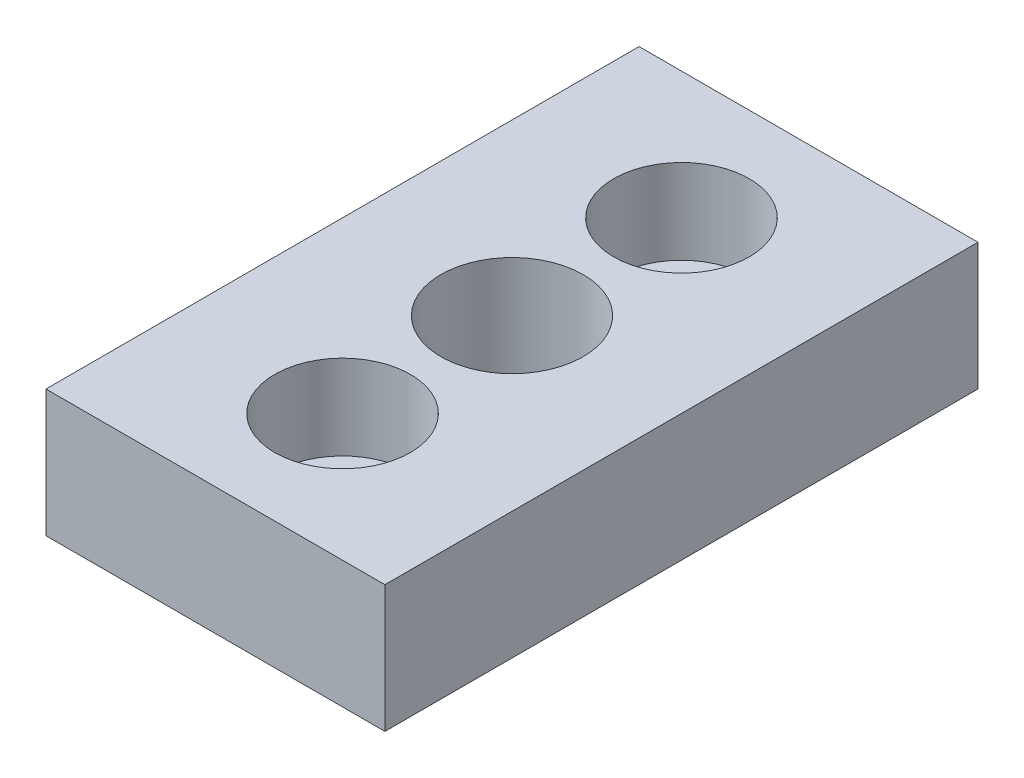
ISO-10303-21;
HEADER;
FILE_DESCRIPTION(('STEP AP214'),'2;1');
FILE_NAME('part.step','',(''),(''),'','','');
FILE_SCHEMA(('AUTOMOTIVE_DESIGN { 1 0 10303 214 1 1 1 1 }'));
ENDSEC;
DATA;
#1=APPLICATION_CONTEXT('core data for automotive mechanical design processes');
#2=APPLICATION_PROTOCOL_DEFINITION('international standard','automotive_design',2000,#1);
#3=PRODUCT_CONTEXT('',#1,'mechanical');
#4=PRODUCT('Part','Part','',(#3));
#5=PRODUCT_RELATED_PRODUCT_CATEGORY('part','',(#4));
#6=PRODUCT_DEFINITION_FORMATION('','',#4);
#7=PRODUCT_DEFINITION_CONTEXT('part definition',#1,'design');
#8=PRODUCT_DEFINITION('design','',#6,#7);
#9=PRODUCT_DEFINITION_SHAPE('','',#8);
#10=(LENGTH_UNIT() NAMED_UNIT(*) SI_UNIT(.MILLI.,.METRE.));
#11=(NAMED_UNIT(*) PLANE_ANGLE_UNIT() SI_UNIT($,.RADIAN.));
#12=(NAMED_UNIT(*) SI_UNIT($,.STERADIAN.) SOLID_ANGLE_UNIT());
#13=UNCERTAINTY_MEASURE_WITH_UNIT(LENGTH_MEASURE(1.E-05),#10,'distance_accuracy_value','');
#14=(GEOMETRIC_REPRESENTATION_CONTEXT(3) GLOBAL_UNCERTAINTY_ASSIGNED_CONTEXT((#13)) GLOBAL_UNIT_ASSIGNED_CONTEXT((#10,
#11,#12)) REPRESENTATION_CONTEXT('',''));
#15=CARTESIAN_POINT('',(0.,0.,0.));
#16=DIRECTION('',(0.,0.,1.));
#17=DIRECTION('',(1.,0.,0.));
#18=AXIS2_PLACEMENT_3D('',#15,#16,#17);
#19=CARTESIAN_POINT('',(0.,7.5,9.99999999999982));
#20=DIRECTION('',(0.,-1.,0.));
#21=DIRECTION('',(0.,0.,-1.));
#22=AXIS2_PLACEMENT_3D('',#19,#20,#21);
#23=CYLINDRICAL_SURFACE('',#22,2.5);
#24=CARTESIAN_POINT('',(0.,0.,9.99999999999982));
#25=DIRECTION('',(0.,-1.,0.));
#26=DIRECTION('',(0.,0.,-1.));
#27=AXIS2_PLACEMENT_3D('',#24,#25,#26);
#28=CIRCLE('',#27,2.5);
#29=CARTESIAN_POINT('',(0.,0.,7.49999999999982));
#30=VERTEX_POINT('',#29);
#31=EDGE_CURVE('E150',#30,#30,#28,.T.);
#32=ORIENTED_EDGE('',*,*,#31,.T.);
#33=EDGE_LOOP('',(#32));
#34=FACE_BOUND('',#33,.T.);
#35=CARTESIAN_POINT('',(0.,2.5,9.99999999999982));
#36=DIRECTION('',(0.,1.,0.));
#37=DIRECTION('',(0.,0.,1.));
#38=AXIS2_PLACEMENT_3D('',#35,#36,#37);
#39=CIRCLE('',#38,2.5);
#40=CARTESIAN_POINT('',(0.,2.5,12.4999999999998));
#41=VERTEX_POINT('',#40);
#42=EDGE_CURVE('E46',#41,#41,#39,.F.);
#43=ORIENTED_EDGE('',*,*,#42,.F.);
#44=EDGE_LOOP('',(#43));
#45=FACE_BOUND('',#44,.T.);
#46=ADVANCED_FACE('F42',(#34,#45),#23,.F.);
#47=CARTESIAN_POINT('',(0.,7.5,-10.0000000000002));
#48=DIRECTION('',(0.,-1.,0.));
#49=DIRECTION('',(0.,0.,-1.));
#50=AXIS2_PLACEMENT_3D('',#47,#48,#49);
#51=CYLINDRICAL_SURFACE('',#50,2.5);
#52=CARTESIAN_POINT('',(0.,0.,-10.0000000000002));
#53=DIRECTION('',(0.,-1.,0.));
#54=DIRECTION('',(0.,0.,-1.));
#55=AXIS2_PLACEMENT_3D('',#52,#53,#54);
#56=CIRCLE('',#55,2.5);
#57=CARTESIAN_POINT('',(0.,0.,-12.5000000000002));
#58=VERTEX_POINT('',#57);
#59=EDGE_CURVE('E167',#58,#58,#56,.T.);
#60=ORIENTED_EDGE('',*,*,#59,.T.);
#61=EDGE_LOOP('',(#60));
#62=FACE_BOUND('',#61,.T.);
#63=CARTESIAN_POINT('',(0.,2.5,-10.0000000000002));
#64=DIRECTION('',(0.,1.,0.));
#65=DIRECTION('',(0.,0.,1.));
#66=AXIS2_PLACEMENT_3D('',#63,#64,#65);
#67=CIRCLE('',#66,2.5);
#68=CARTESIAN_POINT('',(0.,2.5,-7.50000000000018));
#69=VERTEX_POINT('',#68);
#70=EDGE_CURVE('E140',#69,#69,#67,.F.);
#71=ORIENTED_EDGE('',*,*,#70,.F.);
#72=EDGE_LOOP('',(#71));
#73=FACE_BOUND('',#72,.T.);
#74=ADVANCED_FACE('F189',(#62,#73),#51,.F.);
#75=CARTESIAN_POINT('',(-10.,7.5,17.5));
#76=DIRECTION('',(-1.,0.,0.));
#77=DIRECTION('',(0.,0.,1.));
#78=AXIS2_PLACEMENT_3D('',#75,#76,#77);
#79=PLANE('',#78);
#80=DIRECTION('',(0.,0.,-1.));
#81=VECTOR('',#80,1.);
#82=CARTESIAN_POINT('',(-10.,0.,17.5));
#83=LINE('',#82,#81);
#84=CARTESIAN_POINT('',(-10.,0.,17.5));
#85=VERTEX_POINT('',#84);
#86=CARTESIAN_POINT('',(-10.,0.,-17.5));
#87=VERTEX_POINT('',#86);
#88=EDGE_CURVE('E125',#85,#87,#83,.T.);
#89=ORIENTED_EDGE('',*,*,#88,.F.);
#90=DIRECTION('',(0.,-1.,0.));
#91=VECTOR('',#90,1.);
#92=CARTESIAN_POINT('',(-10.,7.5,17.5));
#93=LINE('',#92,#91);
#94=CARTESIAN_POINT('',(-10.,7.5,17.5));
#95=VERTEX_POINT('',#94);
#96=EDGE_CURVE('E11',#95,#85,#93,.T.);
#97=ORIENTED_EDGE('',*,*,#96,.F.);
#98=DIRECTION('',(0.,0.,-1.));
#99=VECTOR('',#98,1.);
#100=CARTESIAN_POINT('',(-10.,7.5,17.5));
#101=LINE('',#100,#99);
#102=CARTESIAN_POINT('',(-10.,7.5,-17.5));
#103=VERTEX_POINT('',#102);
#104=EDGE_CURVE('E116',#95,#103,#101,.T.);
#105=ORIENTED_EDGE('',*,*,#104,.T.);
#106=DIRECTION('',(0.,-1.,0.));
#107=VECTOR('',#106,1.);
#108=CARTESIAN_POINT('',(-10.,7.5,-17.5));
#109=LINE('',#108,#107);
#110=EDGE_CURVE('E92',#103,#87,#109,.T.);
#111=ORIENTED_EDGE('',*,*,#110,.T.);
#112=EDGE_LOOP('',(#89,#97,#105,#111));
#113=FACE_BOUND('',#112,.T.);
#114=ADVANCED_FACE('F44',(#113),#79,.T.);
#115=CARTESIAN_POINT('',(-10.,7.5,17.5));
#116=DIRECTION('',(0.,0.,-1.));
#117=DIRECTION('',(-1.,0.,0.));
#118=AXIS2_PLACEMENT_3D('',#115,#116,#117);
#119=PLANE('',#118);
#120=DIRECTION('',(1.,0.,0.));
#121=VECTOR('',#120,1.);
#122=CARTESIAN_POINT('',(-10.,0.,17.5));
#123=LINE('',#122,#121);
#124=CARTESIAN_POINT('',(10.,0.,17.5));
#125=VERTEX_POINT('',#124);
#126=EDGE_CURVE('E83',#85,#125,#123,.T.);
#127=ORIENTED_EDGE('',*,*,#126,.T.);
#128=DIRECTION('',(0.,-1.,0.));
#129=VECTOR('',#128,1.);
#130=CARTESIAN_POINT('',(10.,7.5,17.5));
#131=LINE('',#130,#129);
#132=CARTESIAN_POINT('',(10.,7.5,17.5));
#133=VERTEX_POINT('',#132);
#134=EDGE_CURVE('E53',#133,#125,#131,.T.);
#135=ORIENTED_EDGE('',*,*,#134,.F.);
#136=DIRECTION('',(1.,0.,0.));
#137=VECTOR('',#136,1.);
#138=CARTESIAN_POINT('',(-10.,7.5,17.5));
#139=LINE('',#138,#137);
#140=EDGE_CURVE('E102',#95,#133,#139,.T.);
#141=ORIENTED_EDGE('',*,*,#140,.F.);
#142=ORIENTED_EDGE('',*,*,#96,.T.);
#143=EDGE_LOOP('',(#127,#135,#141,#142));
#144=FACE_BOUND('',#143,.T.);
#145=ADVANCED_FACE('F188',(#144),#119,.F.);
#146=CARTESIAN_POINT('',(10.,7.5,17.5));
#147=DIRECTION('',(-1.,0.,0.));
#148=DIRECTION('',(0.,0.,1.));
#149=AXIS2_PLACEMENT_3D('',#146,#147,#148);
#150=PLANE('',#149);
#151=DIRECTION('',(0.,0.,-1.));
#152=VECTOR('',#151,1.);
#153=CARTESIAN_POINT('',(10.,0.,17.5));
#154=LINE('',#153,#152);
#155=CARTESIAN_POINT('',(10.,0.,-17.5));
#156=VERTEX_POINT('',#155);
#157=EDGE_CURVE('E110',#125,#156,#154,.T.);
#158=ORIENTED_EDGE('',*,*,#157,.T.);
#159=DIRECTION('',(0.,-1.,0.));
#160=VECTOR('',#159,1.);
#161=CARTESIAN_POINT('',(10.,7.5,-17.5));
#162=LINE('',#161,#160);
#163=CARTESIAN_POINT('',(10.,7.5,-17.5));
#164=VERTEX_POINT('',#163);
#165=EDGE_CURVE('E107',#164,#156,#162,.T.);
#166=ORIENTED_EDGE('',*,*,#165,.F.);
#167=DIRECTION('',(0.,0.,-1.));
#168=VECTOR('',#167,1.);
#169=CARTESIAN_POINT('',(10.,7.5,17.5));
#170=LINE('',#169,#168);
#171=EDGE_CURVE('E97',#133,#164,#170,.T.);
#172=ORIENTED_EDGE('',*,*,#171,.F.);
#173=ORIENTED_EDGE('',*,*,#134,.T.);
#174=EDGE_LOOP('',(#158,#166,#172,#173));
#175=FACE_BOUND('',#174,.T.);
#176=ADVANCED_FACE('F108',(#175),#150,.F.);
#177=CARTESIAN_POINT('',(-10.,7.5,-17.5));
#178=DIRECTION('',(0.,0.,-1.));
#179=DIRECTION('',(-1.,0.,0.));
#180=AXIS2_PLACEMENT_3D('',#177,#178,#179);
#181=PLANE('',#180);
#182=DIRECTION('',(1.,0.,0.));
#183=VECTOR('',#182,1.);
#184=CARTESIAN_POINT('',(-10.,0.,-17.5));
#185=LINE('',#184,#183);
#186=EDGE_CURVE('E129',#87,#156,#185,.T.);
#187=ORIENTED_EDGE('',*,*,#186,.F.);
#188=ORIENTED_EDGE('',*,*,#110,.F.);
#189=DIRECTION('',(1.,0.,0.));
#190=VECTOR('',#189,1.);
#191=CARTESIAN_POINT('',(-10.,7.5,-17.5));
#192=LINE('',#191,#190);
#193=EDGE_CURVE('E101',#103,#164,#192,.T.);
#194=ORIENTED_EDGE('',*,*,#193,.T.);
#195=ORIENTED_EDGE('',*,*,#165,.T.);
#196=EDGE_LOOP('',(#187,#188,#194,#195));
#197=FACE_BOUND('',#196,.T.);
#198=ADVANCED_FACE('F114',(#197),#181,.T.);
#199=CARTESIAN_POINT('',(0.,7.5,0.));
#200=DIRECTION('',(0.,-1.,0.));
#201=DIRECTION('',(0.,0.,-1.));
#202=AXIS2_PLACEMENT_3D('',#199,#200,#201);
#203=PLANE('',#202);
#204=CARTESIAN_POINT('',(0.,7.5,-10.0000000000002));
#205=DIRECTION('',(0.,1.,0.));
#206=DIRECTION('',(0.,0.,1.));
#207=AXIS2_PLACEMENT_3D('',#204,#205,#206);
#208=CIRCLE('',#207,4.);
#209=CARTESIAN_POINT('',(0.,7.5,-6.00000000000018));
#210=VERTEX_POINT('',#209);
#211=EDGE_CURVE('E152',#210,#210,#208,.T.);
#212=ORIENTED_EDGE('',*,*,#211,.F.);
#213=EDGE_LOOP('',(#212));
#214=FACE_BOUND('',#213,.T.);
#215=CARTESIAN_POINT('',(0.,7.5,9.99999999999982));
#216=DIRECTION('',(0.,1.,0.));
#217=DIRECTION('',(0.,0.,1.));
#218=AXIS2_PLACEMENT_3D('',#215,#216,#217);
#219=CIRCLE('',#218,4.);
#220=CARTESIAN_POINT('',(0.,7.5,13.9999999999998));
#221=VERTEX_POINT('',#220);
#222=EDGE_CURVE('E163',#221,#221,#219,.T.);
#223=ORIENTED_EDGE('',*,*,#222,.F.);
#224=EDGE_LOOP('',(#223));
#225=FACE_BOUND('',#224,.T.);
#226=CARTESIAN_POINT('',(0.,7.5,0.));
#227=DIRECTION('',(0.,-1.,0.));
#228=DIRECTION('',(0.,0.,-1.));
#229=AXIS2_PLACEMENT_3D('',#226,#227,#228);
#230=CIRCLE('',#229,4.2);
#231=CARTESIAN_POINT('',(0.,7.5,-4.2));
#232=VERTEX_POINT('',#231);
#233=EDGE_CURVE('E130',#232,#232,#230,.T.);
#234=ORIENTED_EDGE('',*,*,#233,.T.);
#235=EDGE_LOOP('',(#234));
#236=FACE_BOUND('',#235,.T.);
#237=ORIENTED_EDGE('',*,*,#104,.F.);
#238=ORIENTED_EDGE('',*,*,#140,.T.);
#239=ORIENTED_EDGE('',*,*,#171,.T.);
#240=ORIENTED_EDGE('',*,*,#193,.F.);
#241=EDGE_LOOP('',(#237,#238,#239,#240));
#242=FACE_BOUND('',#241,.T.);
#243=ADVANCED_FACE('F100',(#214,#225,#236,#242),#203,.F.);
#244=CARTESIAN_POINT('',(0.,0.,0.));
#245=DIRECTION('',(0.,-1.,0.));
#246=DIRECTION('',(0.,0.,-1.));
#247=AXIS2_PLACEMENT_3D('',#244,#245,#246);
#248=PLANE('',#247);
#249=ORIENTED_EDGE('',*,*,#59,.F.);
#250=EDGE_LOOP('',(#249));
#251=FACE_BOUND('',#250,.T.);
#252=ORIENTED_EDGE('',*,*,#31,.F.);
#253=EDGE_LOOP('',(#252));
#254=FACE_BOUND('',#253,.T.);
#255=CARTESIAN_POINT('',(0.,0.,0.));
#256=DIRECTION('',(0.,-1.,0.));
#257=DIRECTION('',(0.,0.,-1.));
#258=AXIS2_PLACEMENT_3D('',#255,#256,#257);
#259=CIRCLE('',#258,4.2);
#260=CARTESIAN_POINT('',(0.,0.,-4.2));
#261=VERTEX_POINT('',#260);
#262=EDGE_CURVE('E170',#261,#261,#259,.T.);
#263=ORIENTED_EDGE('',*,*,#262,.F.);
#264=EDGE_LOOP('',(#263));
#265=FACE_BOUND('',#264,.T.);
#266=ORIENTED_EDGE('',*,*,#88,.T.);
#267=ORIENTED_EDGE('',*,*,#186,.T.);
#268=ORIENTED_EDGE('',*,*,#157,.F.);
#269=ORIENTED_EDGE('',*,*,#126,.F.);
#270=EDGE_LOOP('',(#266,#267,#268,#269));
#271=FACE_BOUND('',#270,.T.);
#272=ADVANCED_FACE('F182',(#251,#254,#265,#271),#248,.T.);
#273=CARTESIAN_POINT('',(0.,7.5,0.));
#274=DIRECTION('',(0.,-1.,0.));
#275=DIRECTION('',(0.,0.,-1.));
#276=AXIS2_PLACEMENT_3D('',#273,#274,#275);
#277=CYLINDRICAL_SURFACE('',#276,4.2);
#278=ORIENTED_EDGE('',*,*,#233,.F.);
#279=EDGE_LOOP('',(#278));
#280=FACE_BOUND('',#279,.T.);
#281=ORIENTED_EDGE('',*,*,#262,.T.);
#282=EDGE_LOOP('',(#281));
#283=FACE_BOUND('',#282,.T.);
#284=ADVANCED_FACE('F180',(#280,#283),#277,.F.);
#285=CARTESIAN_POINT('',(0.,2.5,-10.0000000000002));
#286=DIRECTION('',(0.,1.,0.));
#287=DIRECTION('',(0.,0.,1.));
#288=AXIS2_PLACEMENT_3D('',#285,#286,#287);
#289=PLANE('',#288);
#290=CARTESIAN_POINT('',(0.,2.5,-10.0000000000002));
#291=DIRECTION('',(0.,1.,0.));
#292=DIRECTION('',(0.,0.,1.));
#293=AXIS2_PLACEMENT_3D('',#290,#291,#292);
#294=CIRCLE('',#293,4.);
#295=CARTESIAN_POINT('',(0.,2.5,-6.00000000000018));
#296=VERTEX_POINT('',#295);
#297=EDGE_CURVE('E143',#296,#296,#294,.T.);
#298=ORIENTED_EDGE('',*,*,#297,.T.);
#299=EDGE_LOOP('',(#298));
#300=FACE_BOUND('',#299,.T.);
#301=ORIENTED_EDGE('',*,*,#70,.T.);
#302=EDGE_LOOP('',(#301));
#303=FACE_BOUND('',#302,.T.);
#304=ADVANCED_FACE('F207',(#300,#303),#289,.T.);
#305=CARTESIAN_POINT('',(0.,2.5,-10.0000000000002));
#306=DIRECTION('',(0.,1.,0.));
#307=DIRECTION('',(0.,0.,1.));
#308=AXIS2_PLACEMENT_3D('',#305,#306,#307);
#309=CYLINDRICAL_SURFACE('',#308,4.);
#310=ORIENTED_EDGE('',*,*,#297,.F.);
#311=EDGE_LOOP('',(#310));
#312=FACE_BOUND('',#311,.T.);
#313=ORIENTED_EDGE('',*,*,#211,.T.);
#314=EDGE_LOOP('',(#313));
#315=FACE_BOUND('',#314,.T.);
#316=ADVANCED_FACE('F235',(#312,#315),#309,.F.);
#317=CARTESIAN_POINT('',(0.,2.5,9.99999999999982));
#318=DIRECTION('',(0.,1.,0.));
#319=DIRECTION('',(0.,0.,1.));
#320=AXIS2_PLACEMENT_3D('',#317,#318,#319);
#321=PLANE('',#320);
#322=CARTESIAN_POINT('',(0.,2.5,9.99999999999982));
#323=DIRECTION('',(0.,1.,0.));
#324=DIRECTION('',(0.,0.,1.));
#325=AXIS2_PLACEMENT_3D('',#322,#323,#324);
#326=CIRCLE('',#325,4.);
#327=CARTESIAN_POINT('',(0.,2.5,13.9999999999998));
#328=VERTEX_POINT('',#327);
#329=EDGE_CURVE('E157',#328,#328,#326,.T.);
#330=ORIENTED_EDGE('',*,*,#329,.T.);
#331=EDGE_LOOP('',(#330));
#332=FACE_BOUND('',#331,.T.);
#333=ORIENTED_EDGE('',*,*,#42,.T.);
#334=EDGE_LOOP('',(#333));
#335=FACE_BOUND('',#334,.T.);
#336=ADVANCED_FACE('F242',(#332,#335),#321,.T.);
#337=CARTESIAN_POINT('',(0.,2.5,9.99999999999982));
#338=DIRECTION('',(0.,1.,0.));
#339=DIRECTION('',(0.,0.,1.));
#340=AXIS2_PLACEMENT_3D('',#337,#338,#339);
#341=CYLINDRICAL_SURFACE('',#340,4.);
#342=ORIENTED_EDGE('',*,*,#329,.F.);
#343=EDGE_LOOP('',(#342));
#344=FACE_BOUND('',#343,.T.);
#345=ORIENTED_EDGE('',*,*,#222,.T.);
#346=EDGE_LOOP('',(#345));
#347=FACE_BOUND('',#346,.T.);
#348=ADVANCED_FACE('F248',(#344,#347),#341,.F.);
#349=CLOSED_SHELL('',(#46,#74,#114,#145,#176,#198,#243,#272,#284,#304,#316,#336,#348));
#350=MANIFOLD_SOLID_BREP('B2',#349);
#351=ADVANCED_BREP_SHAPE_REPRESENTATION('',(#18,#350),#14);
#352=SHAPE_DEFINITION_REPRESENTATION(#9,#351);
ENDSEC;
END-ISO-10303-21;
